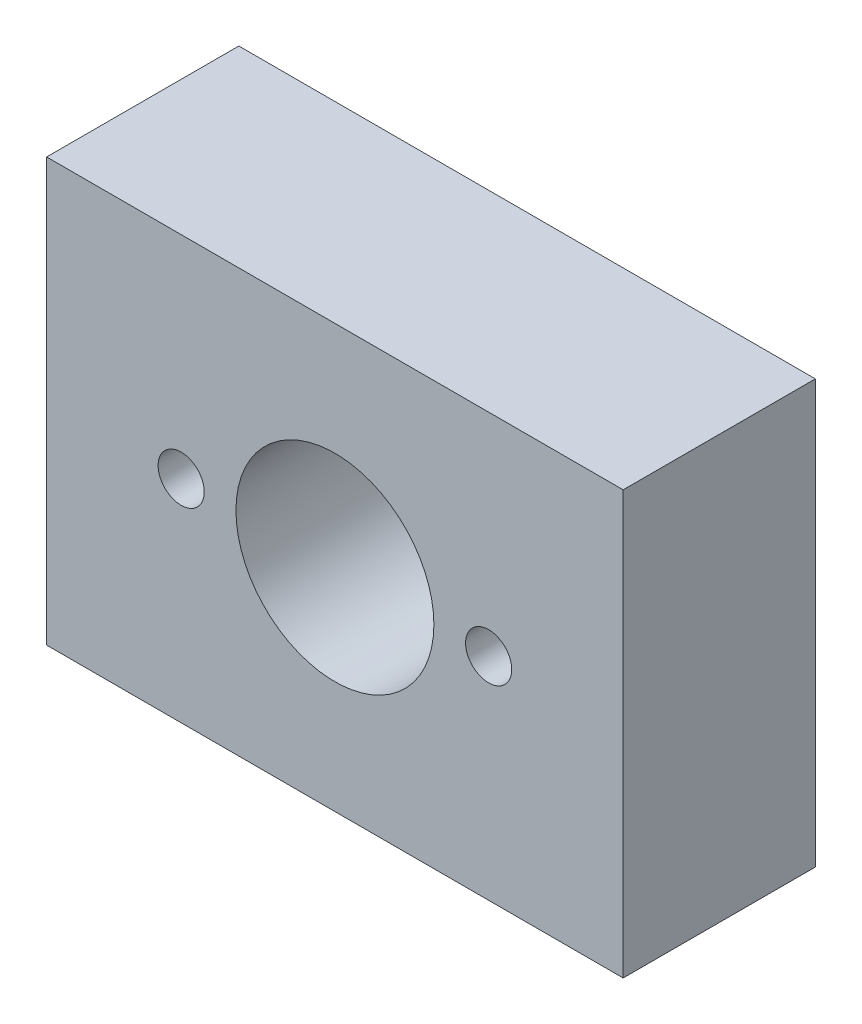
ISO-10303-21;
HEADER;
FILE_DESCRIPTION(('STEP AP214'),'2;1');
FILE_NAME('part.step','',(''),(''),'','','');
FILE_SCHEMA(('AUTOMOTIVE_DESIGN { 1 0 10303 214 1 1 1 1 }'));
ENDSEC;
DATA;
#1=APPLICATION_CONTEXT('core data for automotive mechanical design processes');
#2=APPLICATION_PROTOCOL_DEFINITION('international standard','automotive_design',2000,#1);
#3=PRODUCT_CONTEXT('',#1,'mechanical');
#4=PRODUCT('Part','Part','',(#3));
#5=PRODUCT_RELATED_PRODUCT_CATEGORY('part','',(#4));
#6=PRODUCT_DEFINITION_FORMATION('','',#4);
#7=PRODUCT_DEFINITION_CONTEXT('part definition',#1,'design');
#8=PRODUCT_DEFINITION('design','',#6,#7);
#9=PRODUCT_DEFINITION_SHAPE('','',#8);
#10=(LENGTH_UNIT() NAMED_UNIT(*) SI_UNIT(.MILLI.,.METRE.));
#11=(NAMED_UNIT(*) PLANE_ANGLE_UNIT() SI_UNIT($,.RADIAN.));
#12=(NAMED_UNIT(*) SI_UNIT($,.STERADIAN.) SOLID_ANGLE_UNIT());
#13=UNCERTAINTY_MEASURE_WITH_UNIT(LENGTH_MEASURE(1.E-05),#10,'distance_accuracy_value','');
#14=(GEOMETRIC_REPRESENTATION_CONTEXT(3) GLOBAL_UNCERTAINTY_ASSIGNED_CONTEXT((#13)) GLOBAL_UNIT_ASSIGNED_CONTEXT((#10,
#11,#12)) REPRESENTATION_CONTEXT('',''));
#15=CARTESIAN_POINT('',(0.,0.,0.));
#16=DIRECTION('',(0.,0.,1.));
#17=DIRECTION('',(1.,0.,0.));
#18=AXIS2_PLACEMENT_3D('',#15,#16,#17);
#19=CARTESIAN_POINT('',(0.,0.,10.));
#20=DIRECTION('',(0.,0.,1.));
#21=DIRECTION('',(1.,0.,0.));
#22=AXIS2_PLACEMENT_3D('',#19,#20,#21);
#23=PLANE('',#22);
#24=CARTESIAN_POINT('',(-8.,0.,10.));
#25=DIRECTION('',(0.,0.,1.));
#26=DIRECTION('',(1.,0.,0.));
#27=AXIS2_PLACEMENT_3D('',#24,#25,#26);
#28=CIRCLE('',#27,1.2);
#29=CARTESIAN_POINT('',(-6.8,0.,10.));
#30=VERTEX_POINT('',#29);
#31=EDGE_CURVE('E140',#30,#30,#28,.T.);
#32=ORIENTED_EDGE('',*,*,#31,.F.);
#33=EDGE_LOOP('',(#32));
#34=FACE_BOUND('',#33,.T.);
#35=CARTESIAN_POINT('',(8.,0.,10.));
#36=DIRECTION('',(0.,0.,1.));
#37=DIRECTION('',(-1.,0.,0.));
#38=AXIS2_PLACEMENT_3D('',#35,#36,#37);
#39=CIRCLE('',#38,1.2);
#40=CARTESIAN_POINT('',(6.8,0.,10.));
#41=VERTEX_POINT('',#40);
#42=EDGE_CURVE('E134',#41,#41,#39,.T.);
#43=ORIENTED_EDGE('',*,*,#42,.F.);
#44=EDGE_LOOP('',(#43));
#45=FACE_BOUND('',#44,.T.);
#46=DIRECTION('',(0.,-1.,0.));
#47=VECTOR('',#46,1.);
#48=CARTESIAN_POINT('',(-15.,-11.,10.));
#49=LINE('',#48,#47);
#50=CARTESIAN_POINT('',(-15.,11.,10.));
#51=VERTEX_POINT('',#50);
#52=CARTESIAN_POINT('',(-15.,-11.,10.));
#53=VERTEX_POINT('',#52);
#54=EDGE_CURVE('E89',#51,#53,#49,.T.);
#55=ORIENTED_EDGE('',*,*,#54,.T.);
#56=DIRECTION('',(1.,0.,0.));
#57=VECTOR('',#56,1.);
#58=CARTESIAN_POINT('',(15.,-11.,10.));
#59=LINE('',#58,#57);
#60=CARTESIAN_POINT('',(15.,-11.,10.));
#61=VERTEX_POINT('',#60);
#62=EDGE_CURVE('E84',#53,#61,#59,.T.);
#63=ORIENTED_EDGE('',*,*,#62,.T.);
#64=DIRECTION('',(0.,1.,0.));
#65=VECTOR('',#64,1.);
#66=CARTESIAN_POINT('',(15.,-11.,10.));
#67=LINE('',#66,#65);
#68=CARTESIAN_POINT('',(15.,11.,10.));
#69=VERTEX_POINT('',#68);
#70=EDGE_CURVE('E87',#61,#69,#67,.T.);
#71=ORIENTED_EDGE('',*,*,#70,.T.);
#72=DIRECTION('',(-1.,0.,0.));
#73=VECTOR('',#72,1.);
#74=CARTESIAN_POINT('',(15.,11.,10.));
#75=LINE('',#74,#73);
#76=EDGE_CURVE('E54',#69,#51,#75,.T.);
#77=ORIENTED_EDGE('',*,*,#76,.T.);
#78=EDGE_LOOP('',(#55,#63,#71,#77));
#79=FACE_BOUND('',#78,.T.);
#80=CARTESIAN_POINT('',(0.,0.,10.));
#81=DIRECTION('',(0.,0.,1.));
#82=DIRECTION('',(1.,0.,0.));
#83=AXIS2_PLACEMENT_3D('',#80,#81,#82);
#84=CIRCLE('',#83,5.15);
#85=CARTESIAN_POINT('',(5.15,0.,10.));
#86=VERTEX_POINT('',#85);
#87=EDGE_CURVE('E104',#86,#86,#84,.T.);
#88=ORIENTED_EDGE('',*,*,#87,.F.);
#89=EDGE_LOOP('',(#88));
#90=FACE_BOUND('',#89,.T.);
#91=ADVANCED_FACE('F37',(#34,#45,#79,#90),#23,.T.);
#92=CARTESIAN_POINT('',(0.,0.,0.));
#93=DIRECTION('',(0.,0.,1.));
#94=DIRECTION('',(1.,0.,0.));
#95=AXIS2_PLACEMENT_3D('',#92,#93,#94);
#96=PLANE('',#95);
#97=CARTESIAN_POINT('',(-8.,0.,0.));
#98=DIRECTION('',(0.,0.,1.));
#99=DIRECTION('',(1.,0.,0.));
#100=AXIS2_PLACEMENT_3D('',#97,#98,#99);
#101=CIRCLE('',#100,1.2);
#102=CARTESIAN_POINT('',(-6.8,0.,0.));
#103=VERTEX_POINT('',#102);
#104=EDGE_CURVE('E126',#103,#103,#101,.T.);
#105=ORIENTED_EDGE('',*,*,#104,.T.);
#106=EDGE_LOOP('',(#105));
#107=FACE_BOUND('',#106,.T.);
#108=CARTESIAN_POINT('',(8.,0.,0.));
#109=DIRECTION('',(0.,0.,1.));
#110=DIRECTION('',(-1.,0.,0.));
#111=AXIS2_PLACEMENT_3D('',#108,#109,#110);
#112=CIRCLE('',#111,1.2);
#113=CARTESIAN_POINT('',(6.8,0.,0.));
#114=VERTEX_POINT('',#113);
#115=EDGE_CURVE('E137',#114,#114,#112,.T.);
#116=ORIENTED_EDGE('',*,*,#115,.T.);
#117=EDGE_LOOP('',(#116));
#118=FACE_BOUND('',#117,.T.);
#119=DIRECTION('',(0.,-1.,0.));
#120=VECTOR('',#119,1.);
#121=CARTESIAN_POINT('',(-15.,-11.,0.));
#122=LINE('',#121,#120);
#123=CARTESIAN_POINT('',(-15.,11.,0.));
#124=VERTEX_POINT('',#123);
#125=CARTESIAN_POINT('',(-15.,-11.,0.));
#126=VERTEX_POINT('',#125);
#127=EDGE_CURVE('E101',#124,#126,#122,.T.);
#128=ORIENTED_EDGE('',*,*,#127,.F.);
#129=DIRECTION('',(-1.,0.,0.));
#130=VECTOR('',#129,1.);
#131=CARTESIAN_POINT('',(15.,11.,0.));
#132=LINE('',#131,#130);
#133=CARTESIAN_POINT('',(15.,11.,0.));
#134=VERTEX_POINT('',#133);
#135=EDGE_CURVE('E77',#134,#124,#132,.T.);
#136=ORIENTED_EDGE('',*,*,#135,.F.);
#137=DIRECTION('',(0.,1.,0.));
#138=VECTOR('',#137,1.);
#139=CARTESIAN_POINT('',(15.,-11.,0.));
#140=LINE('',#139,#138);
#141=CARTESIAN_POINT('',(15.,-11.,0.));
#142=VERTEX_POINT('',#141);
#143=EDGE_CURVE('E71',#142,#134,#140,.T.);
#144=ORIENTED_EDGE('',*,*,#143,.F.);
#145=DIRECTION('',(1.,0.,0.));
#146=VECTOR('',#145,1.);
#147=CARTESIAN_POINT('',(15.,-11.,0.));
#148=LINE('',#147,#146);
#149=EDGE_CURVE('E93',#126,#142,#148,.T.);
#150=ORIENTED_EDGE('',*,*,#149,.F.);
#151=EDGE_LOOP('',(#128,#136,#144,#150));
#152=FACE_BOUND('',#151,.T.);
#153=CARTESIAN_POINT('',(0.,0.,0.));
#154=DIRECTION('',(0.,0.,1.));
#155=DIRECTION('',(1.,0.,0.));
#156=AXIS2_PLACEMENT_3D('',#153,#154,#155);
#157=CIRCLE('',#156,5.15);
#158=CARTESIAN_POINT('',(5.15,0.,0.));
#159=VERTEX_POINT('',#158);
#160=EDGE_CURVE('E116',#159,#159,#157,.T.);
#161=ORIENTED_EDGE('',*,*,#160,.T.);
#162=EDGE_LOOP('',(#161));
#163=FACE_BOUND('',#162,.T.);
#164=ADVANCED_FACE('F112',(#107,#118,#152,#163),#96,.F.);
#165=CARTESIAN_POINT('',(-15.,-11.,10.));
#166=DIRECTION('',(1.,0.,0.));
#167=DIRECTION('',(0.,0.,-1.));
#168=AXIS2_PLACEMENT_3D('',#165,#166,#167);
#169=PLANE('',#168);
#170=ORIENTED_EDGE('',*,*,#127,.T.);
#171=DIRECTION('',(0.,0.,-1.));
#172=VECTOR('',#171,1.);
#173=CARTESIAN_POINT('',(-15.,-11.,10.));
#174=LINE('',#173,#172);
#175=EDGE_CURVE('E11',#53,#126,#174,.T.);
#176=ORIENTED_EDGE('',*,*,#175,.F.);
#177=ORIENTED_EDGE('',*,*,#54,.F.);
#178=DIRECTION('',(0.,0.,-1.));
#179=VECTOR('',#178,1.);
#180=CARTESIAN_POINT('',(-15.,11.,10.));
#181=LINE('',#180,#179);
#182=EDGE_CURVE('E97',#51,#124,#181,.T.);
#183=ORIENTED_EDGE('',*,*,#182,.T.);
#184=EDGE_LOOP('',(#170,#176,#177,#183));
#185=FACE_BOUND('',#184,.T.);
#186=ADVANCED_FACE('F39',(#185),#169,.F.);
#187=CARTESIAN_POINT('',(15.,-11.,10.));
#188=DIRECTION('',(0.,1.,0.));
#189=DIRECTION('',(0.,0.,1.));
#190=AXIS2_PLACEMENT_3D('',#187,#188,#189);
#191=PLANE('',#190);
#192=CARTESIAN_POINT('',(-11.,-11.,5.));
#193=DIRECTION('',(0.,-1.,0.));
#194=DIRECTION('',(0.,0.,-1.));
#195=AXIS2_PLACEMENT_3D('',#192,#193,#194);
#196=CIRCLE('',#195,2.);
#197=CARTESIAN_POINT('',(-11.,-11.,3.));
#198=VERTEX_POINT('',#197);
#199=EDGE_CURVE('E129',#198,#198,#196,.T.);
#200=ORIENTED_EDGE('',*,*,#199,.F.);
#201=EDGE_LOOP('',(#200));
#202=FACE_BOUND('',#201,.T.);
#203=CARTESIAN_POINT('',(11.,-11.,5.));
#204=DIRECTION('',(0.,-1.,0.));
#205=DIRECTION('',(0.,0.,1.));
#206=AXIS2_PLACEMENT_3D('',#203,#204,#205);
#207=CIRCLE('',#206,2.);
#208=CARTESIAN_POINT('',(11.,-11.,7.));
#209=VERTEX_POINT('',#208);
#210=EDGE_CURVE('E122',#209,#209,#207,.T.);
#211=ORIENTED_EDGE('',*,*,#210,.F.);
#212=EDGE_LOOP('',(#211));
#213=FACE_BOUND('',#212,.T.);
#214=ORIENTED_EDGE('',*,*,#149,.T.);
#215=DIRECTION('',(0.,0.,-1.));
#216=VECTOR('',#215,1.);
#217=CARTESIAN_POINT('',(15.,-11.,10.));
#218=LINE('',#217,#216);
#219=EDGE_CURVE('E46',#61,#142,#218,.T.);
#220=ORIENTED_EDGE('',*,*,#219,.F.);
#221=ORIENTED_EDGE('',*,*,#62,.F.);
#222=ORIENTED_EDGE('',*,*,#175,.T.);
#223=EDGE_LOOP('',(#214,#220,#221,#222));
#224=FACE_BOUND('',#223,.T.);
#225=ADVANCED_FACE('F92',(#202,#213,#224),#191,.F.);
#226=CARTESIAN_POINT('',(15.,-11.,10.));
#227=DIRECTION('',(-1.,0.,0.));
#228=DIRECTION('',(0.,0.,1.));
#229=AXIS2_PLACEMENT_3D('',#226,#227,#228);
#230=PLANE('',#229);
#231=ORIENTED_EDGE('',*,*,#143,.T.);
#232=DIRECTION('',(0.,0.,-1.));
#233=VECTOR('',#232,1.);
#234=CARTESIAN_POINT('',(15.,11.,10.));
#235=LINE('',#234,#233);
#236=EDGE_CURVE('E94',#69,#134,#235,.T.);
#237=ORIENTED_EDGE('',*,*,#236,.F.);
#238=ORIENTED_EDGE('',*,*,#70,.F.);
#239=ORIENTED_EDGE('',*,*,#219,.T.);
#240=EDGE_LOOP('',(#231,#237,#238,#239));
#241=FACE_BOUND('',#240,.T.);
#242=ADVANCED_FACE('F95',(#241),#230,.F.);
#243=CARTESIAN_POINT('',(15.,11.,10.));
#244=DIRECTION('',(0.,-1.,0.));
#245=DIRECTION('',(0.,0.,-1.));
#246=AXIS2_PLACEMENT_3D('',#243,#244,#245);
#247=PLANE('',#246);
#248=ORIENTED_EDGE('',*,*,#135,.T.);
#249=ORIENTED_EDGE('',*,*,#182,.F.);
#250=ORIENTED_EDGE('',*,*,#76,.F.);
#251=ORIENTED_EDGE('',*,*,#236,.T.);
#252=EDGE_LOOP('',(#248,#249,#250,#251));
#253=FACE_BOUND('',#252,.T.);
#254=ADVANCED_FACE('F109',(#253),#247,.F.);
#255=CARTESIAN_POINT('',(0.,0.,10.));
#256=DIRECTION('',(0.,0.,-1.));
#257=DIRECTION('',(-1.,0.,0.));
#258=AXIS2_PLACEMENT_3D('',#255,#256,#257);
#259=CYLINDRICAL_SURFACE('',#258,5.15);
#260=ORIENTED_EDGE('',*,*,#87,.T.);
#261=EDGE_LOOP('',(#260));
#262=FACE_BOUND('',#261,.T.);
#263=ORIENTED_EDGE('',*,*,#160,.F.);
#264=EDGE_LOOP('',(#263));
#265=FACE_BOUND('',#264,.T.);
#266=ADVANCED_FACE('F182',(#262,#265),#259,.F.);
#267=CARTESIAN_POINT('',(11.,-1.,5.));
#268=DIRECTION('',(0.,-1.,0.));
#269=DIRECTION('',(0.,0.,-1.));
#270=AXIS2_PLACEMENT_3D('',#267,#268,#269);
#271=CYLINDRICAL_SURFACE('',#270,2.);
#272=CARTESIAN_POINT('',(11.,-1.,5.));
#273=DIRECTION('',(0.,-1.,0.));
#274=DIRECTION('',(0.,0.,1.));
#275=AXIS2_PLACEMENT_3D('',#272,#273,#274);
#276=CIRCLE('',#275,2.);
#277=CARTESIAN_POINT('',(11.,-1.,7.));
#278=VERTEX_POINT('',#277);
#279=EDGE_CURVE('E125',#278,#278,#276,.T.);
#280=ORIENTED_EDGE('',*,*,#279,.F.);
#281=EDGE_LOOP('',(#280));
#282=FACE_BOUND('',#281,.T.);
#283=ORIENTED_EDGE('',*,*,#210,.T.);
#284=EDGE_LOOP('',(#283));
#285=FACE_BOUND('',#284,.T.);
#286=ADVANCED_FACE('F178',(#282,#285),#271,.F.);
#287=CARTESIAN_POINT('',(11.,-1.,5.));
#288=DIRECTION('',(0.,1.,0.));
#289=DIRECTION('',(0.,0.,1.));
#290=AXIS2_PLACEMENT_3D('',#287,#288,#289);
#291=PLANE('',#290);
#292=ORIENTED_EDGE('',*,*,#279,.T.);
#293=EDGE_LOOP('',(#292));
#294=FACE_BOUND('',#293,.T.);
#295=ADVANCED_FACE('F174',(#294),#291,.F.);
#296=CARTESIAN_POINT('',(-11.,-1.,5.));
#297=DIRECTION('',(0.,-1.,0.));
#298=DIRECTION('',(0.,0.,-1.));
#299=AXIS2_PLACEMENT_3D('',#296,#297,#298);
#300=CYLINDRICAL_SURFACE('',#299,2.);
#301=CARTESIAN_POINT('',(-11.,-1.,5.));
#302=DIRECTION('',(0.,-1.,0.));
#303=DIRECTION('',(0.,0.,-1.));
#304=AXIS2_PLACEMENT_3D('',#301,#302,#303);
#305=CIRCLE('',#304,2.);
#306=CARTESIAN_POINT('',(-11.,-1.,3.));
#307=VERTEX_POINT('',#306);
#308=EDGE_CURVE('E119',#307,#307,#305,.T.);
#309=ORIENTED_EDGE('',*,*,#308,.F.);
#310=EDGE_LOOP('',(#309));
#311=FACE_BOUND('',#310,.T.);
#312=ORIENTED_EDGE('',*,*,#199,.T.);
#313=EDGE_LOOP('',(#312));
#314=FACE_BOUND('',#313,.T.);
#315=ADVANCED_FACE('F167',(#311,#314),#300,.F.);
#316=CARTESIAN_POINT('',(-11.,-1.,5.));
#317=DIRECTION('',(0.,-1.,0.));
#318=DIRECTION('',(0.,0.,-1.));
#319=AXIS2_PLACEMENT_3D('',#316,#317,#318);
#320=PLANE('',#319);
#321=ORIENTED_EDGE('',*,*,#308,.T.);
#322=EDGE_LOOP('',(#321));
#323=FACE_BOUND('',#322,.T.);
#324=ADVANCED_FACE('F161',(#323),#320,.T.);
#325=CARTESIAN_POINT('',(8.,0.,0.));
#326=DIRECTION('',(0.,0.,1.));
#327=DIRECTION('',(1.,0.,0.));
#328=AXIS2_PLACEMENT_3D('',#325,#326,#327);
#329=CYLINDRICAL_SURFACE('',#328,1.2);
#330=ORIENTED_EDGE('',*,*,#115,.F.);
#331=EDGE_LOOP('',(#330));
#332=FACE_BOUND('',#331,.T.);
#333=ORIENTED_EDGE('',*,*,#42,.T.);
#334=EDGE_LOOP('',(#333));
#335=FACE_BOUND('',#334,.T.);
#336=ADVANCED_FACE('F151',(#332,#335),#329,.F.);
#337=CARTESIAN_POINT('',(-8.,0.,0.));
#338=DIRECTION('',(0.,0.,1.));
#339=DIRECTION('',(1.,0.,0.));
#340=AXIS2_PLACEMENT_3D('',#337,#338,#339);
#341=CYLINDRICAL_SURFACE('',#340,1.2);
#342=ORIENTED_EDGE('',*,*,#104,.F.);
#343=EDGE_LOOP('',(#342));
#344=FACE_BOUND('',#343,.T.);
#345=ORIENTED_EDGE('',*,*,#31,.T.);
#346=EDGE_LOOP('',(#345));
#347=FACE_BOUND('',#346,.T.);
#348=ADVANCED_FACE('F148',(#344,#347),#341,.F.);
#349=CLOSED_SHELL('',(#91,#164,#186,#225,#242,#254,#266,#286,#295,#315,#324,#336,#348));
#350=MANIFOLD_SOLID_BREP('B2',#349);
#351=ADVANCED_BREP_SHAPE_REPRESENTATION('',(#18,#350),#14);
#352=SHAPE_DEFINITION_REPRESENTATION(#9,#351);
ENDSEC;
END-ISO-10303-21;
